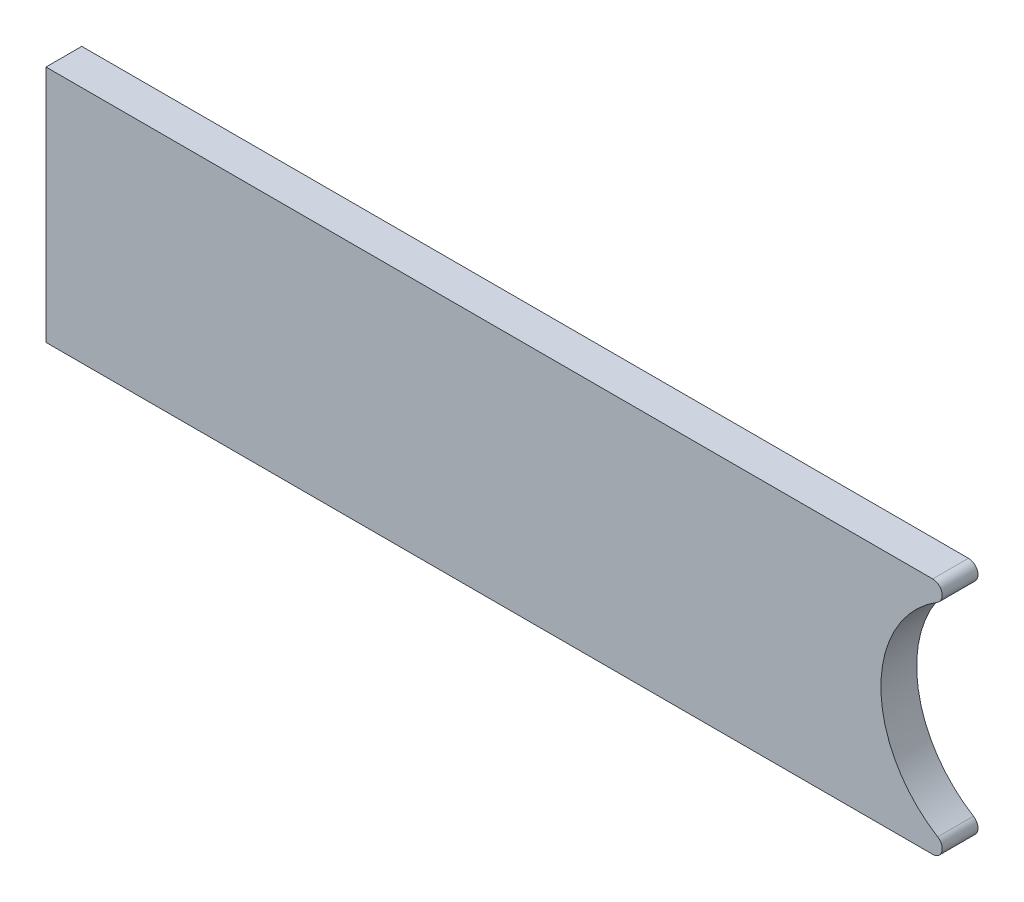
ISO-10303-21;
HEADER;
FILE_DESCRIPTION(('STEP AP214'),'2;1');
FILE_NAME('part.step','',(''),(''),'','','');
FILE_SCHEMA(('AUTOMOTIVE_DESIGN { 1 0 10303 214 1 1 1 1 }'));
ENDSEC;
DATA;
#1=APPLICATION_CONTEXT('core data for automotive mechanical design processes');
#2=APPLICATION_PROTOCOL_DEFINITION('international standard','automotive_design',2000,#1);
#3=PRODUCT_CONTEXT('',#1,'mechanical');
#4=PRODUCT('Part','Part','',(#3));
#5=PRODUCT_RELATED_PRODUCT_CATEGORY('part','',(#4));
#6=PRODUCT_DEFINITION_FORMATION('','',#4);
#7=PRODUCT_DEFINITION_CONTEXT('part definition',#1,'design');
#8=PRODUCT_DEFINITION('design','',#6,#7);
#9=PRODUCT_DEFINITION_SHAPE('','',#8);
#10=(LENGTH_UNIT() NAMED_UNIT(*) SI_UNIT(.MILLI.,.METRE.));
#11=(NAMED_UNIT(*) PLANE_ANGLE_UNIT() SI_UNIT($,.RADIAN.));
#12=(NAMED_UNIT(*) SI_UNIT($,.STERADIAN.) SOLID_ANGLE_UNIT());
#13=UNCERTAINTY_MEASURE_WITH_UNIT(LENGTH_MEASURE(1.E-05),#10,'distance_accuracy_value','');
#14=(GEOMETRIC_REPRESENTATION_CONTEXT(3) GLOBAL_UNCERTAINTY_ASSIGNED_CONTEXT((#13)) GLOBAL_UNIT_ASSIGNED_CONTEXT((#10,
#11,#12)) REPRESENTATION_CONTEXT('',''));
#15=CARTESIAN_POINT('',(0.,0.,0.));
#16=DIRECTION('',(0.,0.,1.));
#17=DIRECTION('',(1.,0.,0.));
#18=AXIS2_PLACEMENT_3D('',#15,#16,#17);
#19=CARTESIAN_POINT('',(-45.9410102568014,28.3117597292724,3.));
#20=DIRECTION('',(1.,0.,0.));
#21=DIRECTION('',(0.,1.,0.));
#22=AXIS2_PLACEMENT_3D('',#19,#20,#21);
#23=PLANE('',#22);
#24=DIRECTION('',(0.,-1.,0.));
#25=VECTOR('',#24,1.);
#26=CARTESIAN_POINT('',(-45.9410102568014,28.3117597292724,0.));
#27=LINE('',#26,#25);
#28=CARTESIAN_POINT('',(-45.9410102568014,28.3117597292724,0.));
#29=VERTEX_POINT('',#28);
#30=CARTESIAN_POINT('',(-45.9410102568014,8.31175972927242,0.));
#31=VERTEX_POINT('',#30);
#32=EDGE_CURVE('E102',#29,#31,#27,.T.);
#33=ORIENTED_EDGE('',*,*,#32,.T.);
#34=DIRECTION('',(0.,0.,-1.));
#35=VECTOR('',#34,1.);
#36=CARTESIAN_POINT('',(-45.9410102568014,8.31175972927242,3.));
#37=LINE('',#36,#35);
#38=CARTESIAN_POINT('',(-45.9410102568014,8.31175972927242,3.));
#39=VERTEX_POINT('',#38);
#40=EDGE_CURVE('E86',#39,#31,#37,.T.);
#41=ORIENTED_EDGE('',*,*,#40,.F.);
#42=DIRECTION('',(0.,-1.,0.));
#43=VECTOR('',#42,1.);
#44=CARTESIAN_POINT('',(-45.9410102568014,28.3117597292724,3.));
#45=LINE('',#44,#43);
#46=CARTESIAN_POINT('',(-45.9410102568014,28.3117597292724,3.));
#47=VERTEX_POINT('',#46);
#48=EDGE_CURVE('E91',#47,#39,#45,.T.);
#49=ORIENTED_EDGE('',*,*,#48,.F.);
#50=DIRECTION('',(0.,0.,-1.));
#51=VECTOR('',#50,1.);
#52=CARTESIAN_POINT('',(-45.9410102568014,28.3117597292724,3.));
#53=LINE('',#52,#51);
#54=EDGE_CURVE('E104',#47,#29,#53,.T.);
#55=ORIENTED_EDGE('',*,*,#54,.T.);
#56=EDGE_LOOP('',(#33,#41,#49,#55));
#57=FACE_BOUND('',#56,.T.);
#58=ADVANCED_FACE('F33',(#57),#23,.F.);
#59=CARTESIAN_POINT('',(-45.9410102568014,8.31175972927242,3.));
#60=DIRECTION('',(0.,1.,0.));
#61=DIRECTION('',(0.,0.,1.));
#62=AXIS2_PLACEMENT_3D('',#59,#60,#61);
#63=PLANE('',#62);
#64=DIRECTION('',(1.,0.,0.));
#65=VECTOR('',#64,1.);
#66=CARTESIAN_POINT('',(-45.9410102568014,8.31175972927242,0.));
#67=LINE('',#66,#65);
#68=CARTESIAN_POINT('',(28.4021354937062,8.31175972927242,0.));
#69=VERTEX_POINT('',#68);
#70=EDGE_CURVE('E142',#31,#69,#67,.T.);
#71=ORIENTED_EDGE('',*,*,#70,.T.);
#72=DIRECTION('',(0.,0.,1.));
#73=VECTOR('',#72,1.);
#74=CARTESIAN_POINT('',(28.4021354937062,8.31175972927242,3.));
#75=LINE('',#74,#73);
#76=CARTESIAN_POINT('',(28.4021354937062,8.31175972927242,3.));
#77=VERTEX_POINT('',#76);
#78=EDGE_CURVE('E41',#69,#77,#75,.T.);
#79=ORIENTED_EDGE('',*,*,#78,.T.);
#80=DIRECTION('',(1.,0.,0.));
#81=VECTOR('',#80,1.);
#82=CARTESIAN_POINT('',(-45.9410102568014,8.31175972927242,3.));
#83=LINE('',#82,#81);
#84=EDGE_CURVE('E82',#39,#77,#83,.T.);
#85=ORIENTED_EDGE('',*,*,#84,.F.);
#86=ORIENTED_EDGE('',*,*,#40,.T.);
#87=EDGE_LOOP('',(#71,#79,#85,#86));
#88=FACE_BOUND('',#87,.T.);
#89=ADVANCED_FACE('F84',(#88),#63,.F.);
#90=CARTESIAN_POINT('',(-45.9410102568014,28.3117597292724,3.));
#91=DIRECTION('',(0.,-1.,0.));
#92=DIRECTION('',(0.,0.,-1.));
#93=AXIS2_PLACEMENT_3D('',#90,#91,#92);
#94=PLANE('',#93);
#95=DIRECTION('',(-1.,0.,0.));
#96=VECTOR('',#95,1.);
#97=CARTESIAN_POINT('',(-45.9410102568014,28.3117597292724,3.));
#98=LINE('',#97,#96);
#99=CARTESIAN_POINT('',(28.4021354937062,28.3117597292724,3.));
#100=VERTEX_POINT('',#99);
#101=EDGE_CURVE('E90',#100,#47,#98,.T.);
#102=ORIENTED_EDGE('',*,*,#101,.F.);
#103=DIRECTION('',(0.,0.,1.));
#104=VECTOR('',#103,1.);
#105=CARTESIAN_POINT('',(28.4021354937062,28.3117597292724,3.));
#106=LINE('',#105,#104);
#107=CARTESIAN_POINT('',(28.4021354937062,28.3117597292724,0.));
#108=VERTEX_POINT('',#107);
#109=EDGE_CURVE('E106',#100,#108,#106,.F.);
#110=ORIENTED_EDGE('',*,*,#109,.T.);
#111=DIRECTION('',(-1.,0.,0.));
#112=VECTOR('',#111,1.);
#113=CARTESIAN_POINT('',(-45.9410102568014,28.3117597292724,0.));
#114=LINE('',#113,#112);
#115=EDGE_CURVE('E99',#108,#29,#114,.T.);
#116=ORIENTED_EDGE('',*,*,#115,.T.);
#117=ORIENTED_EDGE('',*,*,#54,.F.);
#118=EDGE_LOOP('',(#102,#110,#116,#117));
#119=FACE_BOUND('',#118,.T.);
#120=ADVANCED_FACE('F138',(#119),#94,.F.);
#121=CARTESIAN_POINT('',(0.,0.,3.));
#122=DIRECTION('',(0.,0.,1.));
#123=DIRECTION('',(1.,0.,0.));
#124=AXIS2_PLACEMENT_3D('',#121,#122,#123);
#125=PLANE('',#124);
#126=ORIENTED_EDGE('',*,*,#84,.T.);
#127=CARTESIAN_POINT('',(28.4021354937062,9.11175972927242,3.));
#128=DIRECTION('',(0.,0.,1.));
#129=DIRECTION('',(1.,0.,0.));
#130=AXIS2_PLACEMENT_3D('',#127,#128,#129);
#131=CIRCLE('',#130,0.8);
#132=CARTESIAN_POINT('',(28.8211617344094,9.7932412107539,3.));
#133=VERTEX_POINT('',#132);
#134=EDGE_CURVE('E11',#77,#133,#131,.T.);
#135=ORIENTED_EDGE('',*,*,#134,.T.);
#136=CARTESIAN_POINT('',(34.0589897431986,18.3117597292724,3.));
#137=DIRECTION('',(0.,0.,1.));
#138=DIRECTION('',(1.,0.,0.));
#139=AXIS2_PLACEMENT_3D('',#136,#137,#138);
#140=CIRCLE('',#139,10.);
#141=CARTESIAN_POINT('',(28.8211617344094,26.8302782477909,3.));
#142=VERTEX_POINT('',#141);
#143=EDGE_CURVE('E129',#142,#133,#140,.T.);
#144=ORIENTED_EDGE('',*,*,#143,.F.);
#145=CARTESIAN_POINT('',(28.4021354937062,27.5117597292724,3.));
#146=DIRECTION('',(0.,0.,1.));
#147=DIRECTION('',(1.,0.,0.));
#148=AXIS2_PLACEMENT_3D('',#145,#146,#147);
#149=CIRCLE('',#148,0.8);
#150=EDGE_CURVE('E117',#142,#100,#149,.T.);
#151=ORIENTED_EDGE('',*,*,#150,.T.);
#152=ORIENTED_EDGE('',*,*,#101,.T.);
#153=ORIENTED_EDGE('',*,*,#48,.T.);
#154=EDGE_LOOP('',(#126,#135,#144,#151,#152,#153));
#155=FACE_BOUND('',#154,.T.);
#156=ADVANCED_FACE('F94',(#155),#125,.T.);
#157=CARTESIAN_POINT('',(0.,0.,0.));
#158=DIRECTION('',(0.,0.,1.));
#159=DIRECTION('',(1.,0.,0.));
#160=AXIS2_PLACEMENT_3D('',#157,#158,#159);
#161=PLANE('',#160);
#162=CARTESIAN_POINT('',(34.0589897431986,18.3117597292724,0.));
#163=DIRECTION('',(0.,0.,1.));
#164=DIRECTION('',(1.,0.,0.));
#165=AXIS2_PLACEMENT_3D('',#162,#163,#164);
#166=CIRCLE('',#165,10.);
#167=CARTESIAN_POINT('',(28.8211617344094,26.8302782477909,0.));
#168=VERTEX_POINT('',#167);
#169=CARTESIAN_POINT('',(28.8211617344094,9.7932412107539,0.));
#170=VERTEX_POINT('',#169);
#171=EDGE_CURVE('E103',#168,#170,#166,.T.);
#172=ORIENTED_EDGE('',*,*,#171,.T.);
#173=CARTESIAN_POINT('',(28.4021354937062,9.11175972927242,0.));
#174=DIRECTION('',(0.,0.,1.));
#175=DIRECTION('',(1.,0.,0.));
#176=AXIS2_PLACEMENT_3D('',#173,#174,#175);
#177=CIRCLE('',#176,0.8);
#178=EDGE_CURVE('E55',#170,#69,#177,.F.);
#179=ORIENTED_EDGE('',*,*,#178,.T.);
#180=ORIENTED_EDGE('',*,*,#70,.F.);
#181=ORIENTED_EDGE('',*,*,#32,.F.);
#182=ORIENTED_EDGE('',*,*,#115,.F.);
#183=CARTESIAN_POINT('',(28.4021354937062,27.5117597292724,0.));
#184=DIRECTION('',(0.,0.,1.));
#185=DIRECTION('',(1.,0.,0.));
#186=AXIS2_PLACEMENT_3D('',#183,#184,#185);
#187=CIRCLE('',#186,0.8);
#188=EDGE_CURVE('E113',#108,#168,#187,.F.);
#189=ORIENTED_EDGE('',*,*,#188,.T.);
#190=EDGE_LOOP('',(#172,#179,#180,#181,#182,#189));
#191=FACE_BOUND('',#190,.T.);
#192=ADVANCED_FACE('F131',(#191),#161,.F.);
#193=CARTESIAN_POINT('',(34.0589897431986,18.3117597292724,-7.));
#194=DIRECTION('',(0.,0.,1.));
#195=DIRECTION('',(1.,0.,0.));
#196=AXIS2_PLACEMENT_3D('',#193,#194,#195);
#197=CYLINDRICAL_SURFACE('',#196,10.);
#198=ORIENTED_EDGE('',*,*,#143,.T.);
#199=DIRECTION('',(0.,0.,1.));
#200=VECTOR('',#199,1.);
#201=CARTESIAN_POINT('',(28.8211617344094,9.7932412107539,-7.));
#202=LINE('',#201,#200);
#203=EDGE_CURVE('E119',#133,#170,#202,.F.);
#204=ORIENTED_EDGE('',*,*,#203,.T.);
#205=ORIENTED_EDGE('',*,*,#171,.F.);
#206=DIRECTION('',(0.,0.,1.));
#207=VECTOR('',#206,1.);
#208=CARTESIAN_POINT('',(28.8211617344094,26.8302782477909,-7.));
#209=LINE('',#208,#207);
#210=EDGE_CURVE('E115',#168,#142,#209,.T.);
#211=ORIENTED_EDGE('',*,*,#210,.T.);
#212=EDGE_LOOP('',(#198,#204,#205,#211));
#213=FACE_BOUND('',#212,.T.);
#214=ADVANCED_FACE('F126',(#213),#197,.F.);
#215=CARTESIAN_POINT('',(28.4021354937062,27.5117597292724,-7.));
#216=DIRECTION('',(0.,0.,1.));
#217=DIRECTION('',(1.,0.,0.));
#218=AXIS2_PLACEMENT_3D('',#215,#216,#217);
#219=CYLINDRICAL_SURFACE('',#218,0.8);
#220=ORIENTED_EDGE('',*,*,#150,.F.);
#221=ORIENTED_EDGE('',*,*,#210,.F.);
#222=ORIENTED_EDGE('',*,*,#188,.F.);
#223=ORIENTED_EDGE('',*,*,#109,.F.);
#224=EDGE_LOOP('',(#220,#221,#222,#223));
#225=FACE_BOUND('',#224,.T.);
#226=ADVANCED_FACE('F136',(#225),#219,.T.);
#227=CARTESIAN_POINT('',(28.4021354937062,9.11175972927242,-7.));
#228=DIRECTION('',(0.,0.,1.));
#229=DIRECTION('',(1.,0.,0.));
#230=AXIS2_PLACEMENT_3D('',#227,#228,#229);
#231=CYLINDRICAL_SURFACE('',#230,0.8);
#232=ORIENTED_EDGE('',*,*,#134,.F.);
#233=ORIENTED_EDGE('',*,*,#78,.F.);
#234=ORIENTED_EDGE('',*,*,#178,.F.);
#235=ORIENTED_EDGE('',*,*,#203,.F.);
#236=EDGE_LOOP('',(#232,#233,#234,#235));
#237=FACE_BOUND('',#236,.T.);
#238=ADVANCED_FACE('F35',(#237),#231,.T.);
#239=CLOSED_SHELL('',(#58,#89,#120,#156,#192,#214,#226,#238));
#240=MANIFOLD_SOLID_BREP('B2',#239);
#241=ADVANCED_BREP_SHAPE_REPRESENTATION('',(#18,#240),#14);
#242=SHAPE_DEFINITION_REPRESENTATION(#9,#241);
ENDSEC;
END-ISO-10303-21;
